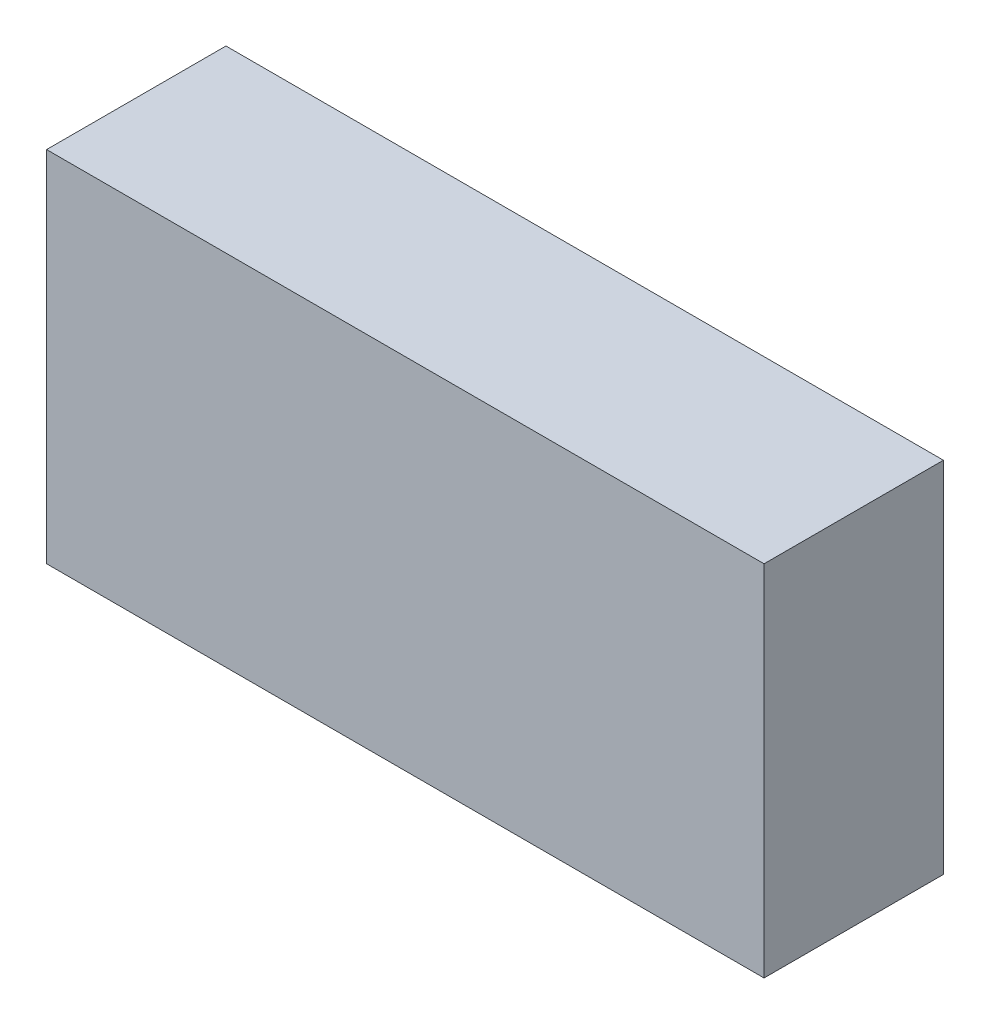
ISO-10303-21;
HEADER;
FILE_DESCRIPTION(('STEP AP214'),'2;1');
FILE_NAME('part.step','',(''),(''),'','','');
FILE_SCHEMA(('AUTOMOTIVE_DESIGN { 1 0 10303 214 1 1 1 1 }'));
ENDSEC;
DATA;
#1=APPLICATION_CONTEXT('core data for automotive mechanical design processes');
#2=APPLICATION_PROTOCOL_DEFINITION('international standard','automotive_design',2000,#1);
#3=PRODUCT_CONTEXT('',#1,'mechanical');
#4=PRODUCT('Part','Part','',(#3));
#5=PRODUCT_RELATED_PRODUCT_CATEGORY('part','',(#4));
#6=PRODUCT_DEFINITION_FORMATION('','',#4);
#7=PRODUCT_DEFINITION_CONTEXT('part definition',#1,'design');
#8=PRODUCT_DEFINITION('design','',#6,#7);
#9=PRODUCT_DEFINITION_SHAPE('','',#8);
#10=(LENGTH_UNIT() NAMED_UNIT(*) SI_UNIT(.MILLI.,.METRE.));
#11=(NAMED_UNIT(*) PLANE_ANGLE_UNIT() SI_UNIT($,.RADIAN.));
#12=(NAMED_UNIT(*) SI_UNIT($,.STERADIAN.) SOLID_ANGLE_UNIT());
#13=UNCERTAINTY_MEASURE_WITH_UNIT(LENGTH_MEASURE(1.E-05),#10,'distance_accuracy_value','');
#14=(GEOMETRIC_REPRESENTATION_CONTEXT(3) GLOBAL_UNCERTAINTY_ASSIGNED_CONTEXT((#13)) GLOBAL_UNIT_ASSIGNED_CONTEXT((#10,
#11,#12)) REPRESENTATION_CONTEXT('',''));
#15=CARTESIAN_POINT('',(0.,0.,0.));
#16=DIRECTION('',(0.,0.,1.));
#17=DIRECTION('',(1.,0.,0.));
#18=AXIS2_PLACEMENT_3D('',#15,#16,#17);
#19=CARTESIAN_POINT('',(-0.999998,0.50000154,0.499999));
#20=DIRECTION('',(0.,0.,1.));
#21=DIRECTION('',(1.,0.,0.));
#22=AXIS2_PLACEMENT_3D('',#19,#20,#21);
#23=PLANE('',#22);
#24=DIRECTION('',(0.,1.,0.));
#25=VECTOR('',#24,1.);
#26=CARTESIAN_POINT('',(1.00000054,0.50000154,0.499999));
#27=LINE('',#26,#25);
#28=CARTESIAN_POINT('',(1.00000054,0.50000154,0.499999));
#29=VERTEX_POINT('',#28);
#30=CARTESIAN_POINT('',(1.00000054,-0.499999,0.499999));
#31=VERTEX_POINT('',#30);
#32=EDGE_CURVE('E53',#29,#31,#27,.F.);
#33=ORIENTED_EDGE('',*,*,#32,.F.);
#34=DIRECTION('',(1.,0.,0.));
#35=VECTOR('',#34,1.);
#36=CARTESIAN_POINT('',(-0.999998,0.50000154,0.499999));
#37=LINE('',#36,#35);
#38=CARTESIAN_POINT('',(-0.999998,0.50000154,0.499999));
#39=VERTEX_POINT('',#38);
#40=EDGE_CURVE('E68',#39,#29,#37,.T.);
#41=ORIENTED_EDGE('',*,*,#40,.F.);
#42=DIRECTION('',(0.,1.,0.));
#43=VECTOR('',#42,1.);
#44=CARTESIAN_POINT('',(-0.999998,-0.499999,0.499999));
#45=LINE('',#44,#43);
#46=CARTESIAN_POINT('',(-0.999998,-0.499999,0.499999));
#47=VERTEX_POINT('',#46);
#48=EDGE_CURVE('E20',#47,#39,#45,.T.);
#49=ORIENTED_EDGE('',*,*,#48,.F.);
#50=DIRECTION('',(1.,0.,0.));
#51=VECTOR('',#50,1.);
#52=CARTESIAN_POINT('',(1.00000054,-0.499999,0.499999));
#53=LINE('',#52,#51);
#54=EDGE_CURVE('E58',#31,#47,#53,.F.);
#55=ORIENTED_EDGE('',*,*,#54,.F.);
#56=EDGE_LOOP('',(#33,#41,#49,#55));
#57=FACE_BOUND('',#56,.T.);
#58=ADVANCED_FACE('F17',(#57),#23,.T.);
#59=CARTESIAN_POINT('',(-0.999998,-0.499999,0.));
#60=DIRECTION('',(-1.,0.,0.));
#61=DIRECTION('',(0.,0.,1.));
#62=AXIS2_PLACEMENT_3D('',#59,#60,#61);
#63=PLANE('',#62);
#64=DIRECTION('',(0.,0.,1.));
#65=VECTOR('',#64,1.);
#66=CARTESIAN_POINT('',(-0.999998,0.50000154,0.));
#67=LINE('',#66,#65);
#68=CARTESIAN_POINT('',(-0.999998,0.50000154,0.));
#69=VERTEX_POINT('',#68);
#70=EDGE_CURVE('E79',#69,#39,#67,.T.);
#71=ORIENTED_EDGE('',*,*,#70,.F.);
#72=DIRECTION('',(0.,1.,0.));
#73=VECTOR('',#72,1.);
#74=CARTESIAN_POINT('',(-0.999998,0.50000154,0.));
#75=LINE('',#74,#73);
#76=CARTESIAN_POINT('',(-0.999998,-0.499999,0.));
#77=VERTEX_POINT('',#76);
#78=EDGE_CURVE('E74',#69,#77,#75,.F.);
#79=ORIENTED_EDGE('',*,*,#78,.T.);
#80=DIRECTION('',(0.,0.,-1.));
#81=VECTOR('',#80,1.);
#82=CARTESIAN_POINT('',(-0.999998,-0.499999,0.));
#83=LINE('',#82,#81);
#84=EDGE_CURVE('E63',#47,#77,#83,.T.);
#85=ORIENTED_EDGE('',*,*,#84,.F.);
#86=ORIENTED_EDGE('',*,*,#48,.T.);
#87=EDGE_LOOP('',(#71,#79,#85,#86));
#88=FACE_BOUND('',#87,.T.);
#89=ADVANCED_FACE('F73',(#88),#63,.T.);
#90=CARTESIAN_POINT('',(1.00000054,-0.499999,0.));
#91=DIRECTION('',(0.,-1.,0.));
#92=DIRECTION('',(0.,0.,-1.));
#93=AXIS2_PLACEMENT_3D('',#90,#91,#92);
#94=PLANE('',#93);
#95=ORIENTED_EDGE('',*,*,#84,.T.);
#96=DIRECTION('',(1.,0.,0.));
#97=VECTOR('',#96,1.);
#98=CARTESIAN_POINT('',(-0.999998,-0.499999,0.));
#99=LINE('',#98,#97);
#100=CARTESIAN_POINT('',(1.00000054,-0.499999,0.));
#101=VERTEX_POINT('',#100);
#102=EDGE_CURVE('E84',#77,#101,#99,.T.);
#103=ORIENTED_EDGE('',*,*,#102,.T.);
#104=DIRECTION('',(0.,0.,-1.));
#105=VECTOR('',#104,1.);
#106=CARTESIAN_POINT('',(1.00000054,-0.499999,0.));
#107=LINE('',#106,#105);
#108=EDGE_CURVE('E65',#31,#101,#107,.T.);
#109=ORIENTED_EDGE('',*,*,#108,.F.);
#110=ORIENTED_EDGE('',*,*,#54,.T.);
#111=EDGE_LOOP('',(#95,#103,#109,#110));
#112=FACE_BOUND('',#111,.T.);
#113=ADVANCED_FACE('F60',(#112),#94,.T.);
#114=CARTESIAN_POINT('',(1.00000054,0.50000154,0.));
#115=DIRECTION('',(1.,0.,0.));
#116=DIRECTION('',(0.,0.,-1.));
#117=AXIS2_PLACEMENT_3D('',#114,#115,#116);
#118=PLANE('',#117);
#119=ORIENTED_EDGE('',*,*,#108,.T.);
#120=DIRECTION('',(0.,1.,0.));
#121=VECTOR('',#120,1.);
#122=CARTESIAN_POINT('',(1.00000054,0.50000154,0.));
#123=LINE('',#122,#121);
#124=CARTESIAN_POINT('',(1.00000054,0.50000154,0.));
#125=VERTEX_POINT('',#124);
#126=EDGE_CURVE('E26',#101,#125,#123,.T.);
#127=ORIENTED_EDGE('',*,*,#126,.T.);
#128=DIRECTION('',(0.,0.,1.));
#129=VECTOR('',#128,1.);
#130=CARTESIAN_POINT('',(1.00000054,0.50000154,0.));
#131=LINE('',#130,#129);
#132=EDGE_CURVE('E34',#29,#125,#131,.F.);
#133=ORIENTED_EDGE('',*,*,#132,.F.);
#134=ORIENTED_EDGE('',*,*,#32,.T.);
#135=EDGE_LOOP('',(#119,#127,#133,#134));
#136=FACE_BOUND('',#135,.T.);
#137=ADVANCED_FACE('F88',(#136),#118,.T.);
#138=CARTESIAN_POINT('',(-0.999998,0.50000154,0.));
#139=DIRECTION('',(0.,1.,0.));
#140=DIRECTION('',(0.,0.,1.));
#141=AXIS2_PLACEMENT_3D('',#138,#139,#140);
#142=PLANE('',#141);
#143=ORIENTED_EDGE('',*,*,#132,.T.);
#144=DIRECTION('',(1.,0.,0.));
#145=VECTOR('',#144,1.);
#146=CARTESIAN_POINT('',(-0.999998,0.50000154,0.));
#147=LINE('',#146,#145);
#148=EDGE_CURVE('E11',#125,#69,#147,.F.);
#149=ORIENTED_EDGE('',*,*,#148,.T.);
#150=ORIENTED_EDGE('',*,*,#70,.T.);
#151=ORIENTED_EDGE('',*,*,#40,.T.);
#152=EDGE_LOOP('',(#143,#149,#150,#151));
#153=FACE_BOUND('',#152,.T.);
#154=ADVANCED_FACE('F91',(#153),#142,.T.);
#155=CARTESIAN_POINT('',(-0.999998,0.50000154,0.));
#156=DIRECTION('',(0.,0.,1.));
#157=DIRECTION('',(1.,0.,0.));
#158=AXIS2_PLACEMENT_3D('',#155,#156,#157);
#159=PLANE('',#158);
#160=ORIENTED_EDGE('',*,*,#126,.F.);
#161=ORIENTED_EDGE('',*,*,#102,.F.);
#162=ORIENTED_EDGE('',*,*,#78,.F.);
#163=ORIENTED_EDGE('',*,*,#148,.F.);
#164=EDGE_LOOP('',(#160,#161,#162,#163));
#165=FACE_BOUND('',#164,.T.);
#166=ADVANCED_FACE('F90',(#165),#159,.F.);
#167=CLOSED_SHELL('',(#58,#89,#113,#137,#154,#166));
#168=MANIFOLD_SOLID_BREP('B1',#167);
#169=ADVANCED_BREP_SHAPE_REPRESENTATION('',(#18,#168),#14);
#170=SHAPE_DEFINITION_REPRESENTATION(#9,#169);
ENDSEC;
END-ISO-10303-21;
